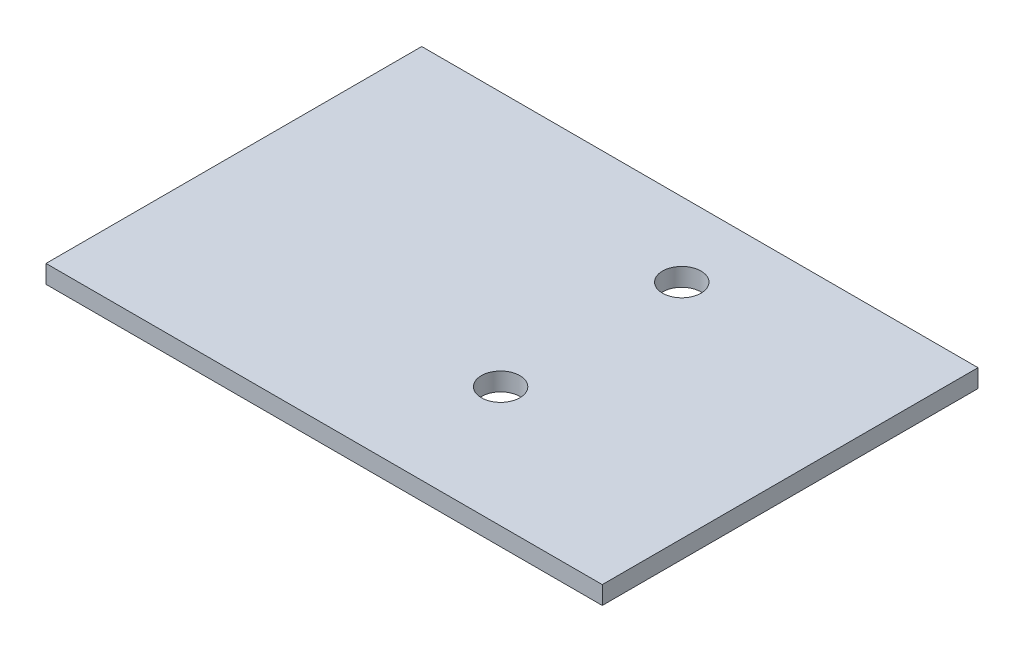
ISO-10303-21;
HEADER;
FILE_DESCRIPTION(('STEP AP214'),'2;1');
FILE_NAME('part.step','',(''),(''),'','','');
FILE_SCHEMA(('AUTOMOTIVE_DESIGN { 1 0 10303 214 1 1 1 1 }'));
ENDSEC;
DATA;
#1=APPLICATION_CONTEXT('core data for automotive mechanical design processes');
#2=APPLICATION_PROTOCOL_DEFINITION('international standard','automotive_design',2000,#1);
#3=PRODUCT_CONTEXT('',#1,'mechanical');
#4=PRODUCT('Part','Part','',(#3));
#5=PRODUCT_RELATED_PRODUCT_CATEGORY('part','',(#4));
#6=PRODUCT_DEFINITION_FORMATION('','',#4);
#7=PRODUCT_DEFINITION_CONTEXT('part definition',#1,'design');
#8=PRODUCT_DEFINITION('design','',#6,#7);
#9=PRODUCT_DEFINITION_SHAPE('','',#8);
#10=(LENGTH_UNIT() NAMED_UNIT(*) SI_UNIT(.MILLI.,.METRE.));
#11=(NAMED_UNIT(*) PLANE_ANGLE_UNIT() SI_UNIT($,.RADIAN.));
#12=(NAMED_UNIT(*) SI_UNIT($,.STERADIAN.) SOLID_ANGLE_UNIT());
#13=UNCERTAINTY_MEASURE_WITH_UNIT(LENGTH_MEASURE(1.E-05),#10,'distance_accuracy_value','');
#14=(GEOMETRIC_REPRESENTATION_CONTEXT(3) GLOBAL_UNCERTAINTY_ASSIGNED_CONTEXT((#13)) GLOBAL_UNIT_ASSIGNED_CONTEXT((#10,
#11,#12)) REPRESENTATION_CONTEXT('',''));
#15=CARTESIAN_POINT('',(0.,0.,0.));
#16=DIRECTION('',(0.,0.,1.));
#17=DIRECTION('',(1.,0.,0.));
#18=AXIS2_PLACEMENT_3D('',#15,#16,#17);
#19=CARTESIAN_POINT('',(0.,1.6,0.));
#20=DIRECTION('',(0.,1.,0.));
#21=DIRECTION('',(0.,0.,1.));
#22=AXIS2_PLACEMENT_3D('',#19,#20,#21);
#23=PLANE('',#22);
#24=CARTESIAN_POINT('',(4.94000000000001,1.6,-10.055));
#25=DIRECTION('',(0.,1.,0.));
#26=DIRECTION('',(0.,0.,1.));
#27=AXIS2_PLACEMENT_3D('',#24,#25,#26);
#28=CIRCLE('',#27,1.7);
#29=CARTESIAN_POINT('',(4.94000000000001,1.6,-8.355));
#30=VERTEX_POINT('',#29);
#31=EDGE_CURVE('E99',#30,#30,#28,.T.);
#32=ORIENTED_EDGE('',*,*,#31,.F.);
#33=EDGE_LOOP('',(#32));
#34=FACE_BOUND('',#33,.T.);
#35=DIRECTION('',(0.,0.,-1.));
#36=VECTOR('',#35,1.);
#37=CARTESIAN_POINT('',(24.57,1.6,-16.595));
#38=LINE('',#37,#36);
#39=CARTESIAN_POINT('',(24.57,1.6,16.595));
#40=VERTEX_POINT('',#39);
#41=CARTESIAN_POINT('',(24.57,1.6,-16.595));
#42=VERTEX_POINT('',#41);
#43=EDGE_CURVE('E84',#40,#42,#38,.T.);
#44=ORIENTED_EDGE('',*,*,#43,.T.);
#45=DIRECTION('',(-1.,0.,0.));
#46=VECTOR('',#45,1.);
#47=CARTESIAN_POINT('',(-24.57,1.6,-16.595));
#48=LINE('',#47,#46);
#49=CARTESIAN_POINT('',(-24.57,1.6,-16.595));
#50=VERTEX_POINT('',#49);
#51=EDGE_CURVE('E79',#42,#50,#48,.T.);
#52=ORIENTED_EDGE('',*,*,#51,.T.);
#53=DIRECTION('',(0.,0.,1.));
#54=VECTOR('',#53,1.);
#55=CARTESIAN_POINT('',(-24.57,1.6,-16.595));
#56=LINE('',#55,#54);
#57=CARTESIAN_POINT('',(-24.57,1.6,16.595));
#58=VERTEX_POINT('',#57);
#59=EDGE_CURVE('E82',#50,#58,#56,.T.);
#60=ORIENTED_EDGE('',*,*,#59,.T.);
#61=DIRECTION('',(1.,0.,0.));
#62=VECTOR('',#61,1.);
#63=CARTESIAN_POINT('',(-24.57,1.6,16.595));
#64=LINE('',#63,#62);
#65=EDGE_CURVE('E49',#58,#40,#64,.T.);
#66=ORIENTED_EDGE('',*,*,#65,.T.);
#67=EDGE_LOOP('',(#44,#52,#60,#66));
#68=FACE_BOUND('',#67,.T.);
#69=CARTESIAN_POINT('',(4.94000000000002,1.6,5.945));
#70=DIRECTION('',(0.,1.,0.));
#71=DIRECTION('',(0.,0.,1.));
#72=AXIS2_PLACEMENT_3D('',#69,#70,#71);
#73=CIRCLE('',#72,1.7);
#74=CARTESIAN_POINT('',(4.94000000000002,1.6,7.645));
#75=VERTEX_POINT('',#74);
#76=EDGE_CURVE('E114',#75,#75,#73,.T.);
#77=ORIENTED_EDGE('',*,*,#76,.F.);
#78=EDGE_LOOP('',(#77));
#79=FACE_BOUND('',#78,.T.);
#80=ADVANCED_FACE('F32',(#34,#68,#79),#23,.T.);
#81=CARTESIAN_POINT('',(0.,0.,0.));
#82=DIRECTION('',(0.,1.,0.));
#83=DIRECTION('',(0.,0.,1.));
#84=AXIS2_PLACEMENT_3D('',#81,#82,#83);
#85=PLANE('',#84);
#86=DIRECTION('',(0.,0.,-1.));
#87=VECTOR('',#86,1.);
#88=CARTESIAN_POINT('',(24.57,0.,-16.595));
#89=LINE('',#88,#87);
#90=CARTESIAN_POINT('',(24.57,0.,16.595));
#91=VERTEX_POINT('',#90);
#92=CARTESIAN_POINT('',(24.57,0.,-16.595));
#93=VERTEX_POINT('',#92);
#94=EDGE_CURVE('E96',#91,#93,#89,.T.);
#95=ORIENTED_EDGE('',*,*,#94,.F.);
#96=DIRECTION('',(1.,0.,0.));
#97=VECTOR('',#96,1.);
#98=CARTESIAN_POINT('',(-24.57,0.,16.595));
#99=LINE('',#98,#97);
#100=CARTESIAN_POINT('',(-24.57,0.,16.595));
#101=VERTEX_POINT('',#100);
#102=EDGE_CURVE('E72',#101,#91,#99,.T.);
#103=ORIENTED_EDGE('',*,*,#102,.F.);
#104=DIRECTION('',(0.,0.,1.));
#105=VECTOR('',#104,1.);
#106=CARTESIAN_POINT('',(-24.57,0.,-16.595));
#107=LINE('',#106,#105);
#108=CARTESIAN_POINT('',(-24.57,0.,-16.595));
#109=VERTEX_POINT('',#108);
#110=EDGE_CURVE('E66',#109,#101,#107,.T.);
#111=ORIENTED_EDGE('',*,*,#110,.F.);
#112=DIRECTION('',(-1.,0.,0.));
#113=VECTOR('',#112,1.);
#114=CARTESIAN_POINT('',(-24.57,0.,-16.595));
#115=LINE('',#114,#113);
#116=EDGE_CURVE('E88',#93,#109,#115,.T.);
#117=ORIENTED_EDGE('',*,*,#116,.F.);
#118=EDGE_LOOP('',(#95,#103,#111,#117));
#119=FACE_BOUND('',#118,.T.);
#120=CARTESIAN_POINT('',(4.94000000000001,0.,-10.055));
#121=DIRECTION('',(0.,1.,0.));
#122=DIRECTION('',(0.,0.,1.));
#123=AXIS2_PLACEMENT_3D('',#120,#121,#122);
#124=CIRCLE('',#123,1.7);
#125=CARTESIAN_POINT('',(4.94000000000001,0.,-8.355));
#126=VERTEX_POINT('',#125);
#127=EDGE_CURVE('E111',#126,#126,#124,.T.);
#128=ORIENTED_EDGE('',*,*,#127,.T.);
#129=EDGE_LOOP('',(#128));
#130=FACE_BOUND('',#129,.T.);
#131=CARTESIAN_POINT('',(4.94000000000002,0.,5.945));
#132=DIRECTION('',(0.,1.,0.));
#133=DIRECTION('',(0.,0.,1.));
#134=AXIS2_PLACEMENT_3D('',#131,#132,#133);
#135=CIRCLE('',#134,1.7);
#136=CARTESIAN_POINT('',(4.94000000000002,0.,7.645));
#137=VERTEX_POINT('',#136);
#138=EDGE_CURVE('E117',#137,#137,#135,.T.);
#139=ORIENTED_EDGE('',*,*,#138,.T.);
#140=EDGE_LOOP('',(#139));
#141=FACE_BOUND('',#140,.T.);
#142=ADVANCED_FACE('F107',(#119,#130,#141),#85,.F.);
#143=CARTESIAN_POINT('',(24.57,1.6,-16.595));
#144=DIRECTION('',(-1.,0.,0.));
#145=DIRECTION('',(0.,0.,1.));
#146=AXIS2_PLACEMENT_3D('',#143,#144,#145);
#147=PLANE('',#146);
#148=ORIENTED_EDGE('',*,*,#94,.T.);
#149=DIRECTION('',(0.,-1.,0.));
#150=VECTOR('',#149,1.);
#151=CARTESIAN_POINT('',(24.57,1.6,-16.595));
#152=LINE('',#151,#150);
#153=EDGE_CURVE('E11',#42,#93,#152,.T.);
#154=ORIENTED_EDGE('',*,*,#153,.F.);
#155=ORIENTED_EDGE('',*,*,#43,.F.);
#156=DIRECTION('',(0.,-1.,0.));
#157=VECTOR('',#156,1.);
#158=CARTESIAN_POINT('',(24.57,1.6,16.595));
#159=LINE('',#158,#157);
#160=EDGE_CURVE('E92',#40,#91,#159,.T.);
#161=ORIENTED_EDGE('',*,*,#160,.T.);
#162=EDGE_LOOP('',(#148,#154,#155,#161));
#163=FACE_BOUND('',#162,.T.);
#164=ADVANCED_FACE('F34',(#163),#147,.F.);
#165=CARTESIAN_POINT('',(-24.57,1.6,-16.595));
#166=DIRECTION('',(0.,0.,1.));
#167=DIRECTION('',(1.,0.,0.));
#168=AXIS2_PLACEMENT_3D('',#165,#166,#167);
#169=PLANE('',#168);
#170=ORIENTED_EDGE('',*,*,#116,.T.);
#171=DIRECTION('',(0.,-1.,0.));
#172=VECTOR('',#171,1.);
#173=CARTESIAN_POINT('',(-24.57,1.6,-16.595));
#174=LINE('',#173,#172);
#175=EDGE_CURVE('E41',#50,#109,#174,.T.);
#176=ORIENTED_EDGE('',*,*,#175,.F.);
#177=ORIENTED_EDGE('',*,*,#51,.F.);
#178=ORIENTED_EDGE('',*,*,#153,.T.);
#179=EDGE_LOOP('',(#170,#176,#177,#178));
#180=FACE_BOUND('',#179,.T.);
#181=ADVANCED_FACE('F87',(#180),#169,.F.);
#182=CARTESIAN_POINT('',(-24.57,1.6,-16.595));
#183=DIRECTION('',(1.,0.,0.));
#184=DIRECTION('',(0.,0.,-1.));
#185=AXIS2_PLACEMENT_3D('',#182,#183,#184);
#186=PLANE('',#185);
#187=ORIENTED_EDGE('',*,*,#110,.T.);
#188=DIRECTION('',(0.,-1.,0.));
#189=VECTOR('',#188,1.);
#190=CARTESIAN_POINT('',(-24.57,1.6,16.595));
#191=LINE('',#190,#189);
#192=EDGE_CURVE('E89',#58,#101,#191,.T.);
#193=ORIENTED_EDGE('',*,*,#192,.F.);
#194=ORIENTED_EDGE('',*,*,#59,.F.);
#195=ORIENTED_EDGE('',*,*,#175,.T.);
#196=EDGE_LOOP('',(#187,#193,#194,#195));
#197=FACE_BOUND('',#196,.T.);
#198=ADVANCED_FACE('F90',(#197),#186,.F.);
#199=CARTESIAN_POINT('',(-24.57,1.6,16.595));
#200=DIRECTION('',(0.,0.,-1.));
#201=DIRECTION('',(-1.,0.,0.));
#202=AXIS2_PLACEMENT_3D('',#199,#200,#201);
#203=PLANE('',#202);
#204=ORIENTED_EDGE('',*,*,#102,.T.);
#205=ORIENTED_EDGE('',*,*,#160,.F.);
#206=ORIENTED_EDGE('',*,*,#65,.F.);
#207=ORIENTED_EDGE('',*,*,#192,.T.);
#208=EDGE_LOOP('',(#204,#205,#206,#207));
#209=FACE_BOUND('',#208,.T.);
#210=ADVANCED_FACE('F104',(#209),#203,.F.);
#211=CARTESIAN_POINT('',(4.94000000000001,1.6,-10.055));
#212=DIRECTION('',(0.,-1.,0.));
#213=DIRECTION('',(0.,0.,-1.));
#214=AXIS2_PLACEMENT_3D('',#211,#212,#213);
#215=CYLINDRICAL_SURFACE('',#214,1.7);
#216=ORIENTED_EDGE('',*,*,#31,.T.);
#217=EDGE_LOOP('',(#216));
#218=FACE_BOUND('',#217,.T.);
#219=ORIENTED_EDGE('',*,*,#127,.F.);
#220=EDGE_LOOP('',(#219));
#221=FACE_BOUND('',#220,.T.);
#222=ADVANCED_FACE('F134',(#218,#221),#215,.F.);
#223=CARTESIAN_POINT('',(4.94000000000002,1.6,5.945));
#224=DIRECTION('',(0.,-1.,0.));
#225=DIRECTION('',(0.,0.,-1.));
#226=AXIS2_PLACEMENT_3D('',#223,#224,#225);
#227=CYLINDRICAL_SURFACE('',#226,1.7);
#228=ORIENTED_EDGE('',*,*,#76,.T.);
#229=EDGE_LOOP('',(#228));
#230=FACE_BOUND('',#229,.T.);
#231=ORIENTED_EDGE('',*,*,#138,.F.);
#232=EDGE_LOOP('',(#231));
#233=FACE_BOUND('',#232,.T.);
#234=ADVANCED_FACE('F123',(#230,#233),#227,.F.);
#235=CLOSED_SHELL('',(#80,#142,#164,#181,#198,#210,#222,#234));
#236=MANIFOLD_SOLID_BREP('B2',#235);
#237=ADVANCED_BREP_SHAPE_REPRESENTATION('',(#18,#236),#14);
#238=SHAPE_DEFINITION_REPRESENTATION(#9,#237);
ENDSEC;
END-ISO-10303-21;
